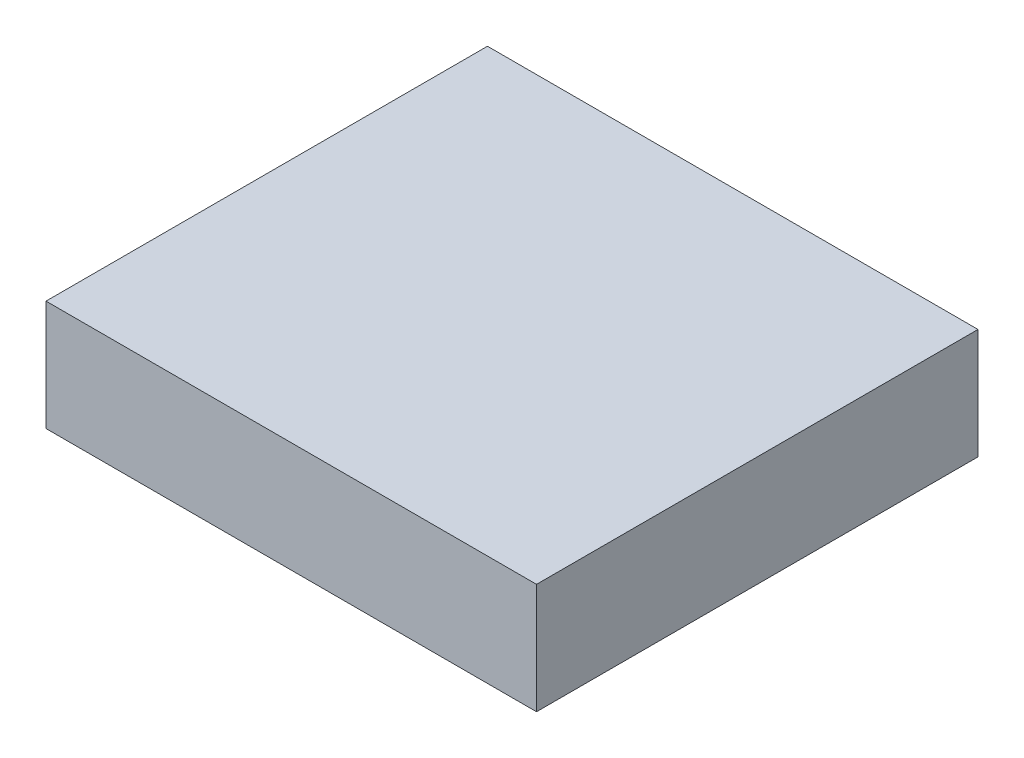
ISO-10303-21;
HEADER;
FILE_DESCRIPTION(('STEP AP214'),'2;1');
FILE_NAME('part.step','',(''),(''),'','','');
FILE_SCHEMA(('AUTOMOTIVE_DESIGN { 1 0 10303 214 1 1 1 1 }'));
ENDSEC;
DATA;
#1=APPLICATION_CONTEXT('core data for automotive mechanical design processes');
#2=APPLICATION_PROTOCOL_DEFINITION('international standard','automotive_design',2000,#1);
#3=PRODUCT_CONTEXT('',#1,'mechanical');
#4=PRODUCT('Part','Part','',(#3));
#5=PRODUCT_RELATED_PRODUCT_CATEGORY('part','',(#4));
#6=PRODUCT_DEFINITION_FORMATION('','',#4);
#7=PRODUCT_DEFINITION_CONTEXT('part definition',#1,'design');
#8=PRODUCT_DEFINITION('design','',#6,#7);
#9=PRODUCT_DEFINITION_SHAPE('','',#8);
#10=(LENGTH_UNIT() NAMED_UNIT(*) SI_UNIT(.MILLI.,.METRE.));
#11=(NAMED_UNIT(*) PLANE_ANGLE_UNIT() SI_UNIT($,.RADIAN.));
#12=(NAMED_UNIT(*) SI_UNIT($,.STERADIAN.) SOLID_ANGLE_UNIT());
#13=UNCERTAINTY_MEASURE_WITH_UNIT(LENGTH_MEASURE(1.E-05),#10,'distance_accuracy_value','');
#14=(GEOMETRIC_REPRESENTATION_CONTEXT(3) GLOBAL_UNCERTAINTY_ASSIGNED_CONTEXT((#13)) GLOBAL_UNIT_ASSIGNED_CONTEXT((#10,
#11,#12)) REPRESENTATION_CONTEXT('',''));
#15=CARTESIAN_POINT('',(0.,0.,0.));
#16=DIRECTION('',(0.,0.,1.));
#17=DIRECTION('',(1.,0.,0.));
#18=AXIS2_PLACEMENT_3D('',#15,#16,#17);
#19=CARTESIAN_POINT('',(0.,22.5,0.));
#20=DIRECTION('',(1.,0.,0.));
#21=DIRECTION('',(0.,0.,-1.));
#22=AXIS2_PLACEMENT_3D('',#19,#20,#21);
#23=PLANE('',#22);
#24=DIRECTION('',(0.,0.,1.));
#25=VECTOR('',#24,1.);
#26=CARTESIAN_POINT('',(0.,0.,0.));
#27=LINE('',#26,#25);
#28=CARTESIAN_POINT('',(0.,0.,-90.));
#29=VERTEX_POINT('',#28);
#30=CARTESIAN_POINT('',(0.,0.,0.));
#31=VERTEX_POINT('',#30);
#32=EDGE_CURVE('E107',#29,#31,#27,.T.);
#33=ORIENTED_EDGE('',*,*,#32,.T.);
#34=DIRECTION('',(0.,-1.,0.));
#35=VECTOR('',#34,1.);
#36=CARTESIAN_POINT('',(0.,22.5,0.));
#37=LINE('',#36,#35);
#38=CARTESIAN_POINT('',(0.,22.5,0.));
#39=VERTEX_POINT('',#38);
#40=EDGE_CURVE('E11',#39,#31,#37,.T.);
#41=ORIENTED_EDGE('',*,*,#40,.F.);
#42=DIRECTION('',(0.,0.,1.));
#43=VECTOR('',#42,1.);
#44=CARTESIAN_POINT('',(0.,22.5,0.));
#45=LINE('',#44,#43);
#46=CARTESIAN_POINT('',(0.,22.5,-90.));
#47=VERTEX_POINT('',#46);
#48=EDGE_CURVE('E91',#47,#39,#45,.T.);
#49=ORIENTED_EDGE('',*,*,#48,.F.);
#50=DIRECTION('',(0.,-1.,0.));
#51=VECTOR('',#50,1.);
#52=CARTESIAN_POINT('',(0.,22.5,-90.));
#53=LINE('',#52,#51);
#54=EDGE_CURVE('E103',#47,#29,#53,.T.);
#55=ORIENTED_EDGE('',*,*,#54,.T.);
#56=EDGE_LOOP('',(#33,#41,#49,#55));
#57=FACE_BOUND('',#56,.T.);
#58=ADVANCED_FACE('F39',(#57),#23,.F.);
#59=CARTESIAN_POINT('',(0.,22.5,0.));
#60=DIRECTION('',(0.,0.,-1.));
#61=DIRECTION('',(-1.,0.,0.));
#62=AXIS2_PLACEMENT_3D('',#59,#60,#61);
#63=PLANE('',#62);
#64=DIRECTION('',(1.,0.,0.));
#65=VECTOR('',#64,1.);
#66=CARTESIAN_POINT('',(0.,0.,0.));
#67=LINE('',#66,#65);
#68=CARTESIAN_POINT('',(100.,0.,0.));
#69=VERTEX_POINT('',#68);
#70=EDGE_CURVE('E96',#31,#69,#67,.T.);
#71=ORIENTED_EDGE('',*,*,#70,.T.);
#72=DIRECTION('',(0.,-1.,0.));
#73=VECTOR('',#72,1.);
#74=CARTESIAN_POINT('',(100.,22.5,0.));
#75=LINE('',#74,#73);
#76=CARTESIAN_POINT('',(100.,22.5,0.));
#77=VERTEX_POINT('',#76);
#78=EDGE_CURVE('E48',#77,#69,#75,.T.);
#79=ORIENTED_EDGE('',*,*,#78,.F.);
#80=DIRECTION('',(1.,0.,0.));
#81=VECTOR('',#80,1.);
#82=CARTESIAN_POINT('',(0.,22.5,0.));
#83=LINE('',#82,#81);
#84=EDGE_CURVE('E86',#39,#77,#83,.T.);
#85=ORIENTED_EDGE('',*,*,#84,.F.);
#86=ORIENTED_EDGE('',*,*,#40,.T.);
#87=EDGE_LOOP('',(#71,#79,#85,#86));
#88=FACE_BOUND('',#87,.T.);
#89=ADVANCED_FACE('F95',(#88),#63,.F.);
#90=CARTESIAN_POINT('',(100.,22.5,0.));
#91=DIRECTION('',(-1.,0.,0.));
#92=DIRECTION('',(0.,0.,1.));
#93=AXIS2_PLACEMENT_3D('',#90,#91,#92);
#94=PLANE('',#93);
#95=DIRECTION('',(0.,0.,-1.));
#96=VECTOR('',#95,1.);
#97=CARTESIAN_POINT('',(100.,0.,0.));
#98=LINE('',#97,#96);
#99=CARTESIAN_POINT('',(100.,0.,-90.));
#100=VERTEX_POINT('',#99);
#101=EDGE_CURVE('E73',#69,#100,#98,.T.);
#102=ORIENTED_EDGE('',*,*,#101,.T.);
#103=DIRECTION('',(0.,-1.,0.));
#104=VECTOR('',#103,1.);
#105=CARTESIAN_POINT('',(100.,22.5,-90.));
#106=LINE('',#105,#104);
#107=CARTESIAN_POINT('',(100.,22.5,-90.));
#108=VERTEX_POINT('',#107);
#109=EDGE_CURVE('E98',#108,#100,#106,.T.);
#110=ORIENTED_EDGE('',*,*,#109,.F.);
#111=DIRECTION('',(0.,0.,-1.));
#112=VECTOR('',#111,1.);
#113=CARTESIAN_POINT('',(100.,22.5,0.));
#114=LINE('',#113,#112);
#115=EDGE_CURVE('E89',#77,#108,#114,.T.);
#116=ORIENTED_EDGE('',*,*,#115,.F.);
#117=ORIENTED_EDGE('',*,*,#78,.T.);
#118=EDGE_LOOP('',(#102,#110,#116,#117));
#119=FACE_BOUND('',#118,.T.);
#120=ADVANCED_FACE('F99',(#119),#94,.F.);
#121=CARTESIAN_POINT('',(0.,22.5,-90.));
#122=DIRECTION('',(0.,0.,1.));
#123=DIRECTION('',(1.,0.,0.));
#124=AXIS2_PLACEMENT_3D('',#121,#122,#123);
#125=PLANE('',#124);
#126=DIRECTION('',(-1.,0.,0.));
#127=VECTOR('',#126,1.);
#128=CARTESIAN_POINT('',(0.,0.,-90.));
#129=LINE('',#128,#127);
#130=EDGE_CURVE('E79',#100,#29,#129,.T.);
#131=ORIENTED_EDGE('',*,*,#130,.T.);
#132=ORIENTED_EDGE('',*,*,#54,.F.);
#133=DIRECTION('',(-1.,0.,0.));
#134=VECTOR('',#133,1.);
#135=CARTESIAN_POINT('',(0.,22.5,-90.));
#136=LINE('',#135,#134);
#137=EDGE_CURVE('E56',#108,#47,#136,.T.);
#138=ORIENTED_EDGE('',*,*,#137,.F.);
#139=ORIENTED_EDGE('',*,*,#109,.T.);
#140=EDGE_LOOP('',(#131,#132,#138,#139));
#141=FACE_BOUND('',#140,.T.);
#142=ADVANCED_FACE('F120',(#141),#125,.F.);
#143=CARTESIAN_POINT('',(0.,22.5,0.));
#144=DIRECTION('',(0.,-1.,0.));
#145=DIRECTION('',(0.,0.,-1.));
#146=AXIS2_PLACEMENT_3D('',#143,#144,#145);
#147=PLANE('',#146);
#148=ORIENTED_EDGE('',*,*,#48,.T.);
#149=ORIENTED_EDGE('',*,*,#84,.T.);
#150=ORIENTED_EDGE('',*,*,#115,.T.);
#151=ORIENTED_EDGE('',*,*,#137,.T.);
#152=EDGE_LOOP('',(#148,#149,#150,#151));
#153=FACE_BOUND('',#152,.T.);
#154=ADVANCED_FACE('F87',(#153),#147,.F.);
#155=CARTESIAN_POINT('',(0.,0.,0.));
#156=DIRECTION('',(0.,-1.,0.));
#157=DIRECTION('',(0.,0.,-1.));
#158=AXIS2_PLACEMENT_3D('',#155,#156,#157);
#159=PLANE('',#158);
#160=ORIENTED_EDGE('',*,*,#32,.F.);
#161=ORIENTED_EDGE('',*,*,#130,.F.);
#162=ORIENTED_EDGE('',*,*,#101,.F.);
#163=ORIENTED_EDGE('',*,*,#70,.F.);
#164=EDGE_LOOP('',(#160,#161,#162,#163));
#165=FACE_BOUND('',#164,.T.);
#166=ADVANCED_FACE('F123',(#165),#159,.T.);
#167=CLOSED_SHELL('',(#58,#89,#120,#142,#154,#166));
#168=MANIFOLD_SOLID_BREP('B2',#167);
#169=ADVANCED_BREP_SHAPE_REPRESENTATION('',(#18,#168),#14);
#170=SHAPE_DEFINITION_REPRESENTATION(#9,#169);
ENDSEC;
END-ISO-10303-21;
